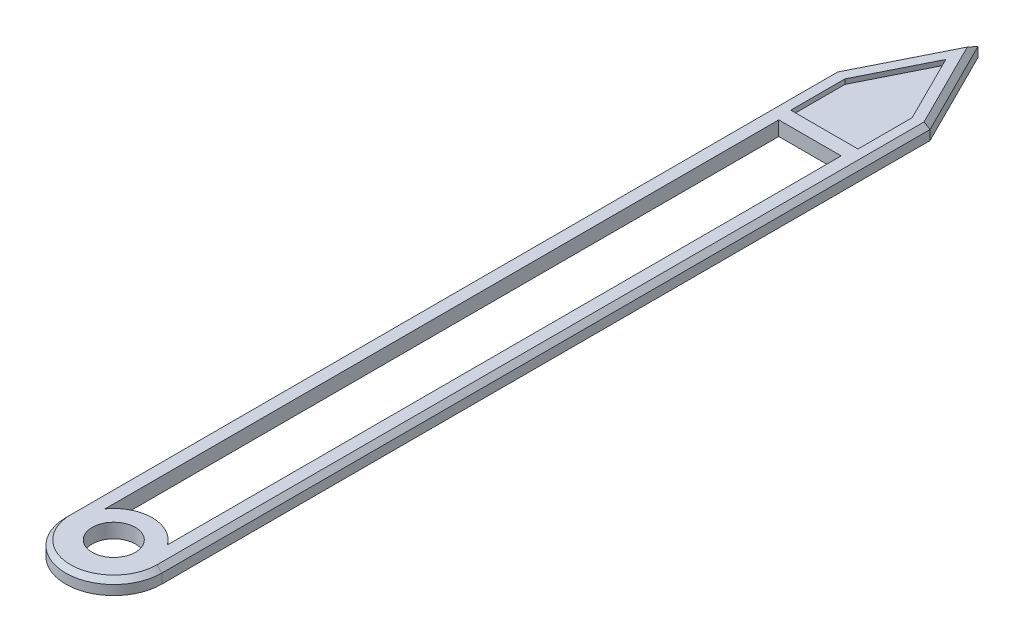
ISO-10303-21;
HEADER;
FILE_DESCRIPTION(('STEP AP214'),'2;1');
FILE_NAME('part.step','',(''),(''),'','','');
FILE_SCHEMA(('AUTOMOTIVE_DESIGN { 1 0 10303 214 1 1 1 1 }'));
ENDSEC;
DATA;
#1=APPLICATION_CONTEXT('core data for automotive mechanical design processes');
#2=APPLICATION_PROTOCOL_DEFINITION('international standard','automotive_design',2000,#1);
#3=PRODUCT_CONTEXT('',#1,'mechanical');
#4=PRODUCT('Part','Part','',(#3));
#5=PRODUCT_RELATED_PRODUCT_CATEGORY('part','',(#4));
#6=PRODUCT_DEFINITION_FORMATION('','',#4);
#7=PRODUCT_DEFINITION_CONTEXT('part definition',#1,'design');
#8=PRODUCT_DEFINITION('design','',#6,#7);
#9=PRODUCT_DEFINITION_SHAPE('','',#8);
#10=(LENGTH_UNIT() NAMED_UNIT(*) SI_UNIT(.MILLI.,.METRE.));
#11=(NAMED_UNIT(*) PLANE_ANGLE_UNIT() SI_UNIT($,.RADIAN.));
#12=(NAMED_UNIT(*) SI_UNIT($,.STERADIAN.) SOLID_ANGLE_UNIT());
#13=UNCERTAINTY_MEASURE_WITH_UNIT(LENGTH_MEASURE(1.E-05),#10,'distance_accuracy_value','');
#14=(GEOMETRIC_REPRESENTATION_CONTEXT(3) GLOBAL_UNCERTAINTY_ASSIGNED_CONTEXT((#13)) GLOBAL_UNIT_ASSIGNED_CONTEXT((#10,
#11,#12)) REPRESENTATION_CONTEXT('',''));
#15=CARTESIAN_POINT('',(0.,0.,0.));
#16=DIRECTION('',(0.,0.,1.));
#17=DIRECTION('',(1.,0.,0.));
#18=AXIS2_PLACEMENT_3D('',#15,#16,#17);
#19=CARTESIAN_POINT('',(0.,0.3,0.));
#20=DIRECTION('',(0.,1.,0.));
#21=DIRECTION('',(0.,0.,1.));
#22=AXIS2_PLACEMENT_3D('',#19,#20,#21);
#23=PLANE('',#22);
#24=DIRECTION('',(-0.447213595499958,0.,0.894427190999916));
#25=VECTOR('',#24,1.);
#26=CARTESIAN_POINT('',(-0.910557280900006,0.3,-15.95527864045));
#27=LINE('',#26,#25);
#28=CARTESIAN_POINT('',(0.,0.3,-17.77639320225));
#29=VERTEX_POINT('',#28);
#30=CARTESIAN_POINT('',(-0.899999999999997,0.3,-15.97639320225));
#31=VERTEX_POINT('',#30);
#32=EDGE_CURVE('E346',#29,#31,#27,.T.);
#33=ORIENTED_EDGE('',*,*,#32,.T.);
#34=DIRECTION('',(0.,0.,1.));
#35=VECTOR('',#34,1.);
#36=CARTESIAN_POINT('',(-0.899999999999997,0.3,0.));
#37=LINE('',#36,#35);
#38=CARTESIAN_POINT('',(-0.899999999999997,0.3,0.));
#39=VERTEX_POINT('',#38);
#40=EDGE_CURVE('E352',#31,#39,#37,.T.);
#41=ORIENTED_EDGE('',*,*,#40,.T.);
#42=CARTESIAN_POINT('',(0.,0.3,0.));
#43=DIRECTION('',(0.,1.,0.));
#44=DIRECTION('',(0.,0.,1.));
#45=AXIS2_PLACEMENT_3D('',#42,#43,#44);
#46=CIRCLE('',#45,0.899999999999997);
#47=CARTESIAN_POINT('',(0.899999999999997,0.3,0.));
#48=VERTEX_POINT('',#47);
#49=EDGE_CURVE('E349',#39,#48,#46,.T.);
#50=ORIENTED_EDGE('',*,*,#49,.T.);
#51=DIRECTION('',(0.,0.,-1.));
#52=VECTOR('',#51,1.);
#53=CARTESIAN_POINT('',(0.899999999999997,0.3,-16.));
#54=LINE('',#53,#52);
#55=CARTESIAN_POINT('',(0.899999999999997,0.3,-15.97639320225));
#56=VERTEX_POINT('',#55);
#57=EDGE_CURVE('E340',#48,#56,#54,.T.);
#58=ORIENTED_EDGE('',*,*,#57,.T.);
#59=DIRECTION('',(-0.447213595499958,0.,-0.894427190999916));
#60=VECTOR('',#59,1.);
#61=CARTESIAN_POINT('',(-0.0894427190999934,0.3,-17.95527864045));
#62=LINE('',#61,#60);
#63=EDGE_CURVE('E343',#56,#29,#62,.T.);
#64=ORIENTED_EDGE('',*,*,#63,.T.);
#65=EDGE_LOOP('',(#33,#41,#50,#58,#64));
#66=FACE_BOUND('',#65,.T.);
#67=DIRECTION('',(0.,0.,-1.));
#68=VECTOR('',#67,1.);
#69=CARTESIAN_POINT('',(0.700000000000001,0.3,-14.8));
#70=LINE('',#69,#68);
#71=CARTESIAN_POINT('',(0.700000000000001,0.3,-14.8));
#72=VERTEX_POINT('',#71);
#73=CARTESIAN_POINT('',(0.700000000000002,0.3,-15.9291796067501));
#74=VERTEX_POINT('',#73);
#75=EDGE_CURVE('E196',#72,#74,#70,.T.);
#76=ORIENTED_EDGE('',*,*,#75,.F.);
#77=DIRECTION('',(1.,0.,0.));
#78=VECTOR('',#77,1.);
#79=CARTESIAN_POINT('',(-0.7,0.3,-14.8));
#80=LINE('',#79,#78);
#81=CARTESIAN_POINT('',(-0.7,0.3,-14.8));
#82=VERTEX_POINT('',#81);
#83=EDGE_CURVE('E217',#82,#72,#80,.T.);
#84=ORIENTED_EDGE('',*,*,#83,.F.);
#85=DIRECTION('',(0.,0.,1.));
#86=VECTOR('',#85,1.);
#87=CARTESIAN_POINT('',(-0.7,0.3,-15.9291796067501));
#88=LINE('',#87,#86);
#89=CARTESIAN_POINT('',(-0.7,0.3,-15.9291796067501));
#90=VERTEX_POINT('',#89);
#91=EDGE_CURVE('E223',#90,#82,#88,.T.);
#92=ORIENTED_EDGE('',*,*,#91,.F.);
#93=DIRECTION('',(-0.447213595499958,0.,0.894427190999916));
#94=VECTOR('',#93,1.);
#95=CARTESIAN_POINT('',(0.,0.3,-17.3291796067501));
#96=LINE('',#95,#94);
#97=CARTESIAN_POINT('',(0.,0.3,-17.3291796067501));
#98=VERTEX_POINT('',#97);
#99=EDGE_CURVE('E237',#98,#90,#96,.T.);
#100=ORIENTED_EDGE('',*,*,#99,.F.);
#101=DIRECTION('',(-0.447213595499959,0.,-0.894427190999916));
#102=VECTOR('',#101,1.);
#103=CARTESIAN_POINT('',(0.700000000000001,0.3,-15.9291796067501));
#104=LINE('',#103,#102);
#105=EDGE_CURVE('E234',#74,#98,#104,.T.);
#106=ORIENTED_EDGE('',*,*,#105,.F.);
#107=EDGE_LOOP('',(#76,#84,#92,#100,#106));
#108=FACE_BOUND('',#107,.T.);
#109=CARTESIAN_POINT('',(0.,0.3,0.));
#110=DIRECTION('',(0.,1.,0.));
#111=DIRECTION('',(0.,0.,1.));
#112=AXIS2_PLACEMENT_3D('',#109,#110,#111);
#113=CIRCLE('',#112,0.45);
#114=CARTESIAN_POINT('',(0.,0.3,0.45));
#115=VERTEX_POINT('',#114);
#116=EDGE_CURVE('E298',#115,#115,#113,.T.);
#117=ORIENTED_EDGE('',*,*,#116,.F.);
#118=EDGE_LOOP('',(#117));
#119=FACE_BOUND('',#118,.T.);
#120=DIRECTION('',(0.,0.,-1.));
#121=VECTOR('',#120,1.);
#122=CARTESIAN_POINT('',(0.65,0.3,-14.5));
#123=LINE('',#122,#121);
#124=CARTESIAN_POINT('',(0.65,0.3,-0.466368952654441));
#125=VERTEX_POINT('',#124);
#126=CARTESIAN_POINT('',(0.65,0.3,-14.5));
#127=VERTEX_POINT('',#126);
#128=EDGE_CURVE('E258',#125,#127,#123,.T.);
#129=ORIENTED_EDGE('',*,*,#128,.F.);
#130=CARTESIAN_POINT('',(0.,0.3,0.));
#131=DIRECTION('',(0.,-1.,0.));
#132=DIRECTION('',(0.,0.,-1.));
#133=AXIS2_PLACEMENT_3D('',#130,#131,#132);
#134=CIRCLE('',#133,0.8);
#135=CARTESIAN_POINT('',(-0.65,0.3,-0.466368952654441));
#136=VERTEX_POINT('',#135);
#137=EDGE_CURVE('E255',#136,#125,#134,.T.);
#138=ORIENTED_EDGE('',*,*,#137,.F.);
#139=DIRECTION('',(0.,0.,1.));
#140=VECTOR('',#139,1.);
#141=CARTESIAN_POINT('',(-0.65,0.3,-0.466368952654441));
#142=LINE('',#141,#140);
#143=CARTESIAN_POINT('',(-0.65,0.3,-14.5));
#144=VERTEX_POINT('',#143);
#145=EDGE_CURVE('E266',#144,#136,#142,.T.);
#146=ORIENTED_EDGE('',*,*,#145,.F.);
#147=DIRECTION('',(-1.,0.,0.));
#148=VECTOR('',#147,1.);
#149=CARTESIAN_POINT('',(-0.65,0.3,-14.5));
#150=LINE('',#149,#148);
#151=EDGE_CURVE('E262',#127,#144,#150,.T.);
#152=ORIENTED_EDGE('',*,*,#151,.F.);
#153=EDGE_LOOP('',(#129,#138,#146,#152));
#154=FACE_BOUND('',#153,.T.);
#155=ADVANCED_FACE('F38',(#66,#108,#119,#154),#23,.T.);
#156=CARTESIAN_POINT('',(0.,0.,0.));
#157=DIRECTION('',(0.,1.,0.));
#158=DIRECTION('',(0.,0.,1.));
#159=AXIS2_PLACEMENT_3D('',#156,#157,#158);
#160=PLANE('',#159);
#161=CARTESIAN_POINT('',(0.,0.,0.));
#162=DIRECTION('',(0.,1.,0.));
#163=DIRECTION('',(0.,0.,1.));
#164=AXIS2_PLACEMENT_3D('',#161,#162,#163);
#165=CIRCLE('',#164,0.45);
#166=CARTESIAN_POINT('',(0.,0.,0.45));
#167=VERTEX_POINT('',#166);
#168=EDGE_CURVE('E297',#167,#167,#165,.T.);
#169=ORIENTED_EDGE('',*,*,#168,.T.);
#170=EDGE_LOOP('',(#169));
#171=FACE_BOUND('',#170,.T.);
#172=CARTESIAN_POINT('',(0.,0.,0.));
#173=DIRECTION('',(0.,1.,0.));
#174=DIRECTION('',(0.,0.,1.));
#175=AXIS2_PLACEMENT_3D('',#172,#173,#174);
#176=CIRCLE('',#175,1.);
#177=CARTESIAN_POINT('',(-1.,0.,0.));
#178=VERTEX_POINT('',#177);
#179=CARTESIAN_POINT('',(1.,0.,0.));
#180=VERTEX_POINT('',#179);
#181=EDGE_CURVE('E302',#178,#180,#176,.T.);
#182=ORIENTED_EDGE('',*,*,#181,.F.);
#183=DIRECTION('',(0.,0.,1.));
#184=VECTOR('',#183,1.);
#185=CARTESIAN_POINT('',(-1.,0.,0.));
#186=LINE('',#185,#184);
#187=CARTESIAN_POINT('',(-1.,0.,-16.));
#188=VERTEX_POINT('',#187);
#189=EDGE_CURVE('E321',#188,#178,#186,.T.);
#190=ORIENTED_EDGE('',*,*,#189,.F.);
#191=DIRECTION('',(-0.447213595499958,0.,0.894427190999916));
#192=VECTOR('',#191,1.);
#193=CARTESIAN_POINT('',(-1.,0.,-16.));
#194=LINE('',#193,#192);
#195=CARTESIAN_POINT('',(0.,0.,-18.));
#196=VERTEX_POINT('',#195);
#197=EDGE_CURVE('E317',#196,#188,#194,.T.);
#198=ORIENTED_EDGE('',*,*,#197,.F.);
#199=DIRECTION('',(-0.447213595499958,0.,-0.894427190999916));
#200=VECTOR('',#199,1.);
#201=CARTESIAN_POINT('',(0.,0.,-18.));
#202=LINE('',#201,#200);
#203=CARTESIAN_POINT('',(1.,0.,-16.));
#204=VERTEX_POINT('',#203);
#205=EDGE_CURVE('E313',#204,#196,#202,.T.);
#206=ORIENTED_EDGE('',*,*,#205,.F.);
#207=DIRECTION('',(0.,0.,-1.));
#208=VECTOR('',#207,1.);
#209=CARTESIAN_POINT('',(1.,0.,0.));
#210=LINE('',#209,#208);
#211=EDGE_CURVE('E309',#180,#204,#210,.T.);
#212=ORIENTED_EDGE('',*,*,#211,.F.);
#213=EDGE_LOOP('',(#182,#190,#198,#206,#212));
#214=FACE_BOUND('',#213,.T.);
#215=CARTESIAN_POINT('',(0.,0.,0.));
#216=DIRECTION('',(0.,-1.,0.));
#217=DIRECTION('',(0.,0.,-1.));
#218=AXIS2_PLACEMENT_3D('',#215,#216,#217);
#219=CIRCLE('',#218,0.8);
#220=CARTESIAN_POINT('',(-0.65,0.,-0.466368952654441));
#221=VERTEX_POINT('',#220);
#222=CARTESIAN_POINT('',(0.65,0.,-0.466368952654441));
#223=VERTEX_POINT('',#222);
#224=EDGE_CURVE('E246',#221,#223,#219,.T.);
#225=ORIENTED_EDGE('',*,*,#224,.T.);
#226=DIRECTION('',(0.,0.,-1.));
#227=VECTOR('',#226,1.);
#228=CARTESIAN_POINT('',(0.65,0.,-14.5));
#229=LINE('',#228,#227);
#230=CARTESIAN_POINT('',(0.65,0.,-14.5));
#231=VERTEX_POINT('',#230);
#232=EDGE_CURVE('E273',#223,#231,#229,.T.);
#233=ORIENTED_EDGE('',*,*,#232,.T.);
#234=DIRECTION('',(-1.,0.,0.));
#235=VECTOR('',#234,1.);
#236=CARTESIAN_POINT('',(-0.65,0.,-14.5));
#237=LINE('',#236,#235);
#238=CARTESIAN_POINT('',(-0.65,0.,-14.5));
#239=VERTEX_POINT('',#238);
#240=EDGE_CURVE('E277',#231,#239,#237,.T.);
#241=ORIENTED_EDGE('',*,*,#240,.T.);
#242=DIRECTION('',(0.,0.,1.));
#243=VECTOR('',#242,1.);
#244=CARTESIAN_POINT('',(-0.65,0.,-0.466368952654441));
#245=LINE('',#244,#243);
#246=EDGE_CURVE('E259',#239,#221,#245,.T.);
#247=ORIENTED_EDGE('',*,*,#246,.T.);
#248=EDGE_LOOP('',(#225,#233,#241,#247));
#249=FACE_BOUND('',#248,.T.);
#250=ADVANCED_FACE('F421',(#171,#214,#249),#160,.F.);
#251=CARTESIAN_POINT('',(0.,0.3,0.));
#252=DIRECTION('',(0.,-1.,0.));
#253=DIRECTION('',(0.,0.,-1.));
#254=AXIS2_PLACEMENT_3D('',#251,#252,#253);
#255=CYLINDRICAL_SURFACE('',#254,1.);
#256=DIRECTION('',(0.,-1.,0.));
#257=VECTOR('',#256,1.);
#258=CARTESIAN_POINT('',(1.,0.3,0.));
#259=LINE('',#258,#257);
#260=CARTESIAN_POINT('',(1.,0.199999999999997,0.));
#261=VERTEX_POINT('',#260);
#262=EDGE_CURVE('E337',#261,#180,#259,.T.);
#263=ORIENTED_EDGE('',*,*,#262,.F.);
#264=CARTESIAN_POINT('',(0.,0.199999999999997,0.));
#265=DIRECTION('',(0.,1.,0.));
#266=DIRECTION('',(0.,0.,1.));
#267=AXIS2_PLACEMENT_3D('',#264,#265,#266);
#268=CIRCLE('',#267,1.);
#269=CARTESIAN_POINT('',(-1.,0.199999999999997,0.));
#270=VERTEX_POINT('',#269);
#271=EDGE_CURVE('E360',#261,#270,#268,.F.);
#272=ORIENTED_EDGE('',*,*,#271,.T.);
#273=DIRECTION('',(0.,-1.,0.));
#274=VECTOR('',#273,1.);
#275=CARTESIAN_POINT('',(-1.,0.3,0.));
#276=LINE('',#275,#274);
#277=EDGE_CURVE('E325',#270,#178,#276,.T.);
#278=ORIENTED_EDGE('',*,*,#277,.T.);
#279=ORIENTED_EDGE('',*,*,#181,.T.);
#280=EDGE_LOOP('',(#263,#272,#278,#279));
#281=FACE_BOUND('',#280,.T.);
#282=ADVANCED_FACE('F404',(#281),#255,.T.);
#283=CARTESIAN_POINT('',(1.,0.3,0.));
#284=DIRECTION('',(-1.,0.,0.));
#285=DIRECTION('',(0.,0.,1.));
#286=AXIS2_PLACEMENT_3D('',#283,#284,#285);
#287=PLANE('',#286);
#288=DIRECTION('',(0.,-1.,0.));
#289=VECTOR('',#288,1.);
#290=CARTESIAN_POINT('',(1.,0.3,-16.));
#291=LINE('',#290,#289);
#292=CARTESIAN_POINT('',(1.,0.199999999999997,-16.));
#293=VERTEX_POINT('',#292);
#294=EDGE_CURVE('E334',#293,#204,#291,.T.);
#295=ORIENTED_EDGE('',*,*,#294,.F.);
#296=DIRECTION('',(0.,0.,1.));
#297=VECTOR('',#296,1.);
#298=CARTESIAN_POINT('',(1.,0.199999999999997,0.));
#299=LINE('',#298,#297);
#300=EDGE_CURVE('E11',#293,#261,#299,.T.);
#301=ORIENTED_EDGE('',*,*,#300,.T.);
#302=ORIENTED_EDGE('',*,*,#262,.T.);
#303=ORIENTED_EDGE('',*,*,#211,.T.);
#304=EDGE_LOOP('',(#295,#301,#302,#303));
#305=FACE_BOUND('',#304,.T.);
#306=ADVANCED_FACE('F440',(#305),#287,.F.);
#307=CARTESIAN_POINT('',(0.,0.3,-18.));
#308=DIRECTION('',(-0.894427190999916,0.,0.447213595499958));
#309=DIRECTION('',(0.447213595499958,0.,0.894427190999916));
#310=AXIS2_PLACEMENT_3D('',#307,#308,#309);
#311=PLANE('',#310);
#312=DIRECTION('',(0.,-1.,0.));
#313=VECTOR('',#312,1.);
#314=CARTESIAN_POINT('',(0.,0.3,-18.));
#315=LINE('',#314,#313);
#316=CARTESIAN_POINT('',(0.,0.199999999999997,-18.));
#317=VERTEX_POINT('',#316);
#318=EDGE_CURVE('E331',#317,#196,#315,.T.);
#319=ORIENTED_EDGE('',*,*,#318,.F.);
#320=DIRECTION('',(0.447213595499958,0.,0.894427190999916));
#321=VECTOR('',#320,1.);
#322=CARTESIAN_POINT('',(1.,0.199999999999997,-16.));
#323=LINE('',#322,#321);
#324=EDGE_CURVE('E48',#317,#293,#323,.T.);
#325=ORIENTED_EDGE('',*,*,#324,.T.);
#326=ORIENTED_EDGE('',*,*,#294,.T.);
#327=ORIENTED_EDGE('',*,*,#205,.T.);
#328=EDGE_LOOP('',(#319,#325,#326,#327));
#329=FACE_BOUND('',#328,.T.);
#330=ADVANCED_FACE('F437',(#329),#311,.F.);
#331=CARTESIAN_POINT('',(-1.,0.3,-16.));
#332=DIRECTION('',(0.894427190999916,0.,0.447213595499958));
#333=DIRECTION('',(0.447213595499958,0.,-0.894427190999916));
#334=AXIS2_PLACEMENT_3D('',#331,#332,#333);
#335=PLANE('',#334);
#336=DIRECTION('',(0.,-1.,0.));
#337=VECTOR('',#336,1.);
#338=CARTESIAN_POINT('',(-1.,0.3,-16.));
#339=LINE('',#338,#337);
#340=CARTESIAN_POINT('',(-1.,0.199999999999997,-16.));
#341=VERTEX_POINT('',#340);
#342=EDGE_CURVE('E328',#341,#188,#339,.T.);
#343=ORIENTED_EDGE('',*,*,#342,.F.);
#344=DIRECTION('',(0.447213595499958,0.,-0.894427190999916));
#345=VECTOR('',#344,1.);
#346=CARTESIAN_POINT('',(0.,0.199999999999996,-18.));
#347=LINE('',#346,#345);
#348=EDGE_CURVE('E69',#341,#317,#347,.T.);
#349=ORIENTED_EDGE('',*,*,#348,.T.);
#350=ORIENTED_EDGE('',*,*,#318,.T.);
#351=ORIENTED_EDGE('',*,*,#197,.T.);
#352=EDGE_LOOP('',(#343,#349,#350,#351));
#353=FACE_BOUND('',#352,.T.);
#354=ADVANCED_FACE('F434',(#353),#335,.F.);
#355=CARTESIAN_POINT('',(-1.,0.3,0.));
#356=DIRECTION('',(1.,0.,0.));
#357=DIRECTION('',(0.,0.,-1.));
#358=AXIS2_PLACEMENT_3D('',#355,#356,#357);
#359=PLANE('',#358);
#360=ORIENTED_EDGE('',*,*,#277,.F.);
#361=DIRECTION('',(0.,0.,-1.));
#362=VECTOR('',#361,1.);
#363=CARTESIAN_POINT('',(-1.,0.199999999999997,-16.));
#364=LINE('',#363,#362);
#365=EDGE_CURVE('E356',#270,#341,#364,.T.);
#366=ORIENTED_EDGE('',*,*,#365,.T.);
#367=ORIENTED_EDGE('',*,*,#342,.T.);
#368=ORIENTED_EDGE('',*,*,#189,.T.);
#369=EDGE_LOOP('',(#360,#366,#367,#368));
#370=FACE_BOUND('',#369,.T.);
#371=ADVANCED_FACE('F407',(#370),#359,.F.);
#372=CARTESIAN_POINT('',(0.,0.3,0.));
#373=DIRECTION('',(0.,-1.,0.));
#374=DIRECTION('',(0.,0.,-1.));
#375=AXIS2_PLACEMENT_3D('',#372,#373,#374);
#376=CYLINDRICAL_SURFACE('',#375,0.45);
#377=ORIENTED_EDGE('',*,*,#116,.T.);
#378=EDGE_LOOP('',(#377));
#379=FACE_BOUND('',#378,.T.);
#380=ORIENTED_EDGE('',*,*,#168,.F.);
#381=EDGE_LOOP('',(#380));
#382=FACE_BOUND('',#381,.T.);
#383=ADVANCED_FACE('F429',(#379,#382),#376,.F.);
#384=CARTESIAN_POINT('',(0.,0.3,0.));
#385=DIRECTION('',(0.,-1.,0.));
#386=DIRECTION('',(0.,0.,-1.));
#387=AXIS2_PLACEMENT_3D('',#384,#385,#386);
#388=CYLINDRICAL_SURFACE('',#387,0.8);
#389=ORIENTED_EDGE('',*,*,#224,.F.);
#390=DIRECTION('',(0.,-1.,0.));
#391=VECTOR('',#390,1.);
#392=CARTESIAN_POINT('',(-0.65,0.3,-0.466368952654441));
#393=LINE('',#392,#391);
#394=EDGE_CURVE('E269',#136,#221,#393,.T.);
#395=ORIENTED_EDGE('',*,*,#394,.F.);
#396=ORIENTED_EDGE('',*,*,#137,.T.);
#397=DIRECTION('',(0.,-1.,0.));
#398=VECTOR('',#397,1.);
#399=CARTESIAN_POINT('',(0.65,0.3,-0.466368952654441));
#400=LINE('',#399,#398);
#401=EDGE_CURVE('E293',#125,#223,#400,.T.);
#402=ORIENTED_EDGE('',*,*,#401,.T.);
#403=EDGE_LOOP('',(#389,#395,#396,#402));
#404=FACE_BOUND('',#403,.T.);
#405=ADVANCED_FACE('F462',(#404),#388,.T.);
#406=CARTESIAN_POINT('',(0.65,0.3,-14.5));
#407=DIRECTION('',(-1.,0.,0.));
#408=DIRECTION('',(0.,0.,1.));
#409=AXIS2_PLACEMENT_3D('',#406,#407,#408);
#410=PLANE('',#409);
#411=ORIENTED_EDGE('',*,*,#232,.F.);
#412=ORIENTED_EDGE('',*,*,#401,.F.);
#413=ORIENTED_EDGE('',*,*,#128,.T.);
#414=DIRECTION('',(0.,-1.,0.));
#415=VECTOR('',#414,1.);
#416=CARTESIAN_POINT('',(0.65,0.3,-14.5));
#417=LINE('',#416,#415);
#418=EDGE_CURVE('E290',#127,#231,#417,.T.);
#419=ORIENTED_EDGE('',*,*,#418,.T.);
#420=EDGE_LOOP('',(#411,#412,#413,#419));
#421=FACE_BOUND('',#420,.T.);
#422=ADVANCED_FACE('F505',(#421),#410,.T.);
#423=CARTESIAN_POINT('',(-0.65,0.3,-14.5));
#424=DIRECTION('',(0.,0.,1.));
#425=DIRECTION('',(1.,0.,0.));
#426=AXIS2_PLACEMENT_3D('',#423,#424,#425);
#427=PLANE('',#426);
#428=ORIENTED_EDGE('',*,*,#240,.F.);
#429=ORIENTED_EDGE('',*,*,#418,.F.);
#430=ORIENTED_EDGE('',*,*,#151,.T.);
#431=DIRECTION('',(0.,-1.,0.));
#432=VECTOR('',#431,1.);
#433=CARTESIAN_POINT('',(-0.65,0.3,-14.5));
#434=LINE('',#433,#432);
#435=EDGE_CURVE('E287',#144,#239,#434,.T.);
#436=ORIENTED_EDGE('',*,*,#435,.T.);
#437=EDGE_LOOP('',(#428,#429,#430,#436));
#438=FACE_BOUND('',#437,.T.);
#439=ADVANCED_FACE('F508',(#438),#427,.T.);
#440=CARTESIAN_POINT('',(-0.65,0.3,-0.466368952654441));
#441=DIRECTION('',(1.,0.,0.));
#442=DIRECTION('',(0.,0.,-1.));
#443=AXIS2_PLACEMENT_3D('',#440,#441,#442);
#444=PLANE('',#443);
#445=ORIENTED_EDGE('',*,*,#246,.F.);
#446=ORIENTED_EDGE('',*,*,#435,.F.);
#447=ORIENTED_EDGE('',*,*,#145,.T.);
#448=ORIENTED_EDGE('',*,*,#394,.T.);
#449=EDGE_LOOP('',(#445,#446,#447,#448));
#450=FACE_BOUND('',#449,.T.);
#451=ADVANCED_FACE('F497',(#450),#444,.T.);
#452=CARTESIAN_POINT('',(0.700000000000001,0.2,-14.8));
#453=DIRECTION('',(1.,0.,0.));
#454=DIRECTION('',(0.,0.,-1.));
#455=AXIS2_PLACEMENT_3D('',#452,#453,#454);
#456=PLANE('',#455);
#457=ORIENTED_EDGE('',*,*,#75,.T.);
#458=DIRECTION('',(0.,1.,0.));
#459=VECTOR('',#458,1.);
#460=CARTESIAN_POINT('',(0.700000000000001,0.2,-15.9291796067501));
#461=LINE('',#460,#459);
#462=CARTESIAN_POINT('',(0.700000000000001,0.2,-15.9291796067501));
#463=VERTEX_POINT('',#462);
#464=EDGE_CURVE('E189',#463,#74,#461,.T.);
#465=ORIENTED_EDGE('',*,*,#464,.F.);
#466=DIRECTION('',(0.,0.,-1.));
#467=VECTOR('',#466,1.);
#468=CARTESIAN_POINT('',(0.700000000000001,0.2,-14.8));
#469=LINE('',#468,#467);
#470=CARTESIAN_POINT('',(0.700000000000001,0.2,-14.8));
#471=VERTEX_POINT('',#470);
#472=EDGE_CURVE('E193',#471,#463,#469,.T.);
#473=ORIENTED_EDGE('',*,*,#472,.F.);
#474=DIRECTION('',(0.,1.,0.));
#475=VECTOR('',#474,1.);
#476=CARTESIAN_POINT('',(0.700000000000001,0.2,-14.8));
#477=LINE('',#476,#475);
#478=EDGE_CURVE('E244',#471,#72,#477,.T.);
#479=ORIENTED_EDGE('',*,*,#478,.T.);
#480=EDGE_LOOP('',(#457,#465,#473,#479));
#481=FACE_BOUND('',#480,.T.);
#482=ADVANCED_FACE('F191',(#481),#456,.F.);
#483=CARTESIAN_POINT('',(-0.7,0.2,-14.8));
#484=DIRECTION('',(0.,0.,1.));
#485=DIRECTION('',(1.,0.,0.));
#486=AXIS2_PLACEMENT_3D('',#483,#484,#485);
#487=PLANE('',#486);
#488=ORIENTED_EDGE('',*,*,#83,.T.);
#489=ORIENTED_EDGE('',*,*,#478,.F.);
#490=DIRECTION('',(1.,0.,0.));
#491=VECTOR('',#490,1.);
#492=CARTESIAN_POINT('',(-0.7,0.2,-14.8));
#493=LINE('',#492,#491);
#494=CARTESIAN_POINT('',(-0.7,0.2,-14.8));
#495=VERTEX_POINT('',#494);
#496=EDGE_CURVE('E202',#495,#471,#493,.T.);
#497=ORIENTED_EDGE('',*,*,#496,.F.);
#498=DIRECTION('',(0.,1.,0.));
#499=VECTOR('',#498,1.);
#500=CARTESIAN_POINT('',(-0.7,0.2,-14.8));
#501=LINE('',#500,#499);
#502=EDGE_CURVE('E247',#495,#82,#501,.T.);
#503=ORIENTED_EDGE('',*,*,#502,.T.);
#504=EDGE_LOOP('',(#488,#489,#497,#503));
#505=FACE_BOUND('',#504,.T.);
#506=ADVANCED_FACE('F529',(#505),#487,.F.);
#507=CARTESIAN_POINT('',(-0.7,0.2,-15.9291796067501));
#508=DIRECTION('',(-1.,0.,0.));
#509=DIRECTION('',(0.,0.,1.));
#510=AXIS2_PLACEMENT_3D('',#507,#508,#509);
#511=PLANE('',#510);
#512=ORIENTED_EDGE('',*,*,#91,.T.);
#513=ORIENTED_EDGE('',*,*,#502,.F.);
#514=DIRECTION('',(0.,0.,1.));
#515=VECTOR('',#514,1.);
#516=CARTESIAN_POINT('',(-0.7,0.2,-15.9291796067501));
#517=LINE('',#516,#515);
#518=CARTESIAN_POINT('',(-0.7,0.2,-15.9291796067501));
#519=VERTEX_POINT('',#518);
#520=EDGE_CURVE('E228',#519,#495,#517,.T.);
#521=ORIENTED_EDGE('',*,*,#520,.F.);
#522=DIRECTION('',(0.,1.,0.));
#523=VECTOR('',#522,1.);
#524=CARTESIAN_POINT('',(-0.7,0.2,-15.9291796067501));
#525=LINE('',#524,#523);
#526=EDGE_CURVE('E250',#519,#90,#525,.T.);
#527=ORIENTED_EDGE('',*,*,#526,.T.);
#528=EDGE_LOOP('',(#512,#513,#521,#527));
#529=FACE_BOUND('',#528,.T.);
#530=ADVANCED_FACE('F536',(#529),#511,.F.);
#531=CARTESIAN_POINT('',(0.,0.2,-17.3291796067501));
#532=DIRECTION('',(-0.894427190999916,0.,-0.447213595499958));
#533=DIRECTION('',(-0.447213595499958,0.,0.894427190999916));
#534=AXIS2_PLACEMENT_3D('',#531,#532,#533);
#535=PLANE('',#534);
#536=ORIENTED_EDGE('',*,*,#99,.T.);
#537=ORIENTED_EDGE('',*,*,#526,.F.);
#538=DIRECTION('',(-0.447213595499958,0.,0.894427190999916));
#539=VECTOR('',#538,1.);
#540=CARTESIAN_POINT('',(0.,0.2,-17.3291796067501));
#541=LINE('',#540,#539);
#542=CARTESIAN_POINT('',(0.,0.2,-17.3291796067501));
#543=VERTEX_POINT('',#542);
#544=EDGE_CURVE('E211',#543,#519,#541,.T.);
#545=ORIENTED_EDGE('',*,*,#544,.F.);
#546=DIRECTION('',(0.,1.,0.));
#547=VECTOR('',#546,1.);
#548=CARTESIAN_POINT('',(0.,0.2,-17.3291796067501));
#549=LINE('',#548,#547);
#550=EDGE_CURVE('E201',#543,#98,#549,.T.);
#551=ORIENTED_EDGE('',*,*,#550,.T.);
#552=EDGE_LOOP('',(#536,#537,#545,#551));
#553=FACE_BOUND('',#552,.T.);
#554=ADVANCED_FACE('F544',(#553),#535,.F.);
#555=CARTESIAN_POINT('',(0.700000000000001,0.2,-15.9291796067501));
#556=DIRECTION('',(0.894427190999916,0.,-0.447213595499959));
#557=DIRECTION('',(-0.447213595499959,0.,-0.894427190999916));
#558=AXIS2_PLACEMENT_3D('',#555,#556,#557);
#559=PLANE('',#558);
#560=ORIENTED_EDGE('',*,*,#105,.T.);
#561=ORIENTED_EDGE('',*,*,#550,.F.);
#562=DIRECTION('',(-0.447213595499959,0.,-0.894427190999916));
#563=VECTOR('',#562,1.);
#564=CARTESIAN_POINT('',(0.700000000000001,0.2,-15.9291796067501));
#565=LINE('',#564,#563);
#566=EDGE_CURVE('E205',#463,#543,#565,.T.);
#567=ORIENTED_EDGE('',*,*,#566,.F.);
#568=ORIENTED_EDGE('',*,*,#464,.T.);
#569=EDGE_LOOP('',(#560,#561,#567,#568));
#570=FACE_BOUND('',#569,.T.);
#571=ADVANCED_FACE('F206',(#570),#559,.F.);
#572=CARTESIAN_POINT('',(0.,0.2,0.));
#573=DIRECTION('',(0.,-1.,0.));
#574=DIRECTION('',(0.,0.,-1.));
#575=AXIS2_PLACEMENT_3D('',#572,#573,#574);
#576=PLANE('',#575);
#577=ORIENTED_EDGE('',*,*,#472,.T.);
#578=ORIENTED_EDGE('',*,*,#566,.T.);
#579=ORIENTED_EDGE('',*,*,#544,.T.);
#580=ORIENTED_EDGE('',*,*,#520,.T.);
#581=ORIENTED_EDGE('',*,*,#496,.T.);
#582=EDGE_LOOP('',(#577,#578,#579,#580,#581));
#583=FACE_BOUND('',#582,.T.);
#584=ADVANCED_FACE('F213',(#583),#576,.F.);
#585=CARTESIAN_POINT('',(7.11055728090001,0.3,-3.55527864045001));
#586=DIRECTION('',(0.632455532033673,0.707106781186551,-0.316227766016837));
#587=DIRECTION('',(0.447213595499958,0.,0.894427190999916));
#588=AXIS2_PLACEMENT_3D('',#585,#586,#587);
#589=PLANE('',#588);
#590=DIRECTION('',(0.,0.408248290463862,0.912870929175277));
#591=VECTOR('',#590,1.);
#592=CARTESIAN_POINT('',(0.,5.59989647933281,-5.92546440075001));
#593=LINE('',#592,#591);
#594=EDGE_CURVE('E376',#29,#317,#593,.F.);
#595=ORIENTED_EDGE('',*,*,#594,.F.);
#596=ORIENTED_EDGE('',*,*,#63,.F.);
#597=DIRECTION('',(-0.697456562333054,0.697456562333054,0.164647160063933));
#598=VECTOR('',#597,1.);
#599=CARTESIAN_POINT('',(-0.934637007365747,2.13463700736574,-15.5432941544749));
#600=LINE('',#599,#598);
#601=EDGE_CURVE('E42',#293,#56,#600,.T.);
#602=ORIENTED_EDGE('',*,*,#601,.F.);
#603=ORIENTED_EDGE('',*,*,#324,.F.);
#604=EDGE_LOOP('',(#595,#596,#602,#603));
#605=FACE_BOUND('',#604,.T.);
#606=ADVANCED_FACE('F40',(#605),#589,.T.);
#607=CARTESIAN_POINT('',(0.899999999999997,0.3,0.));
#608=DIRECTION('',(0.707106781186548,0.707106781186548,0.));
#609=DIRECTION('',(0.,0.,1.));
#610=AXIS2_PLACEMENT_3D('',#607,#608,#609);
#611=PLANE('',#610);
#612=ORIENTED_EDGE('',*,*,#601,.T.);
#613=ORIENTED_EDGE('',*,*,#57,.F.);
#614=DIRECTION('',(-0.707106781186548,0.707106781186548,0.));
#615=VECTOR('',#614,1.);
#616=CARTESIAN_POINT('',(1.,0.199999999999997,0.));
#617=LINE('',#616,#615);
#618=EDGE_CURVE('E373',#261,#48,#617,.T.);
#619=ORIENTED_EDGE('',*,*,#618,.F.);
#620=ORIENTED_EDGE('',*,*,#300,.F.);
#621=EDGE_LOOP('',(#612,#613,#619,#620));
#622=FACE_BOUND('',#621,.T.);
#623=ADVANCED_FACE('F388',(#622),#611,.T.);
#624=CARTESIAN_POINT('',(-7.11055728090001,0.3,-3.55527864045001));
#625=DIRECTION('',(-0.632455532033676,0.707106781186548,-0.316227766016838));
#626=DIRECTION('',(0.447213595499958,0.,-0.894427190999916));
#627=AXIS2_PLACEMENT_3D('',#624,#625,#626);
#628=PLANE('',#627);
#629=ORIENTED_EDGE('',*,*,#594,.T.);
#630=ORIENTED_EDGE('',*,*,#348,.F.);
#631=DIRECTION('',(0.697456562333055,0.697456562333055,0.16464716006392));
#632=VECTOR('',#631,1.);
#633=CARTESIAN_POINT('',(-2.49472933407324,-1.29472933407324,-16.3528577308043));
#634=LINE('',#633,#632);
#635=EDGE_CURVE('E370',#31,#341,#634,.F.);
#636=ORIENTED_EDGE('',*,*,#635,.F.);
#637=ORIENTED_EDGE('',*,*,#32,.F.);
#638=EDGE_LOOP('',(#629,#630,#636,#637));
#639=FACE_BOUND('',#638,.T.);
#640=ADVANCED_FACE('F412',(#639),#628,.T.);
#641=CARTESIAN_POINT('',(0.,0.3,0.));
#642=DIRECTION('',(0.,-1.,0.));
#643=DIRECTION('',(0.,0.,-1.));
#644=AXIS2_PLACEMENT_3D('',#641,#642,#643);
#645=CONICAL_SURFACE('',#644,0.899999999999997,0.785398163397448);
#646=ORIENTED_EDGE('',*,*,#618,.T.);
#647=ORIENTED_EDGE('',*,*,#49,.F.);
#648=DIRECTION('',(0.707106781186548,0.707106781186548,0.));
#649=VECTOR('',#648,1.);
#650=CARTESIAN_POINT('',(-1.,0.199999999999997,0.));
#651=LINE('',#650,#649);
#652=EDGE_CURVE('E367',#270,#39,#651,.T.);
#653=ORIENTED_EDGE('',*,*,#652,.F.);
#654=ORIENTED_EDGE('',*,*,#271,.F.);
#655=EDGE_LOOP('',(#646,#647,#653,#654));
#656=FACE_BOUND('',#655,.T.);
#657=ADVANCED_FACE('F399',(#656),#645,.T.);
#658=CARTESIAN_POINT('',(-0.899999999999997,0.3,0.));
#659=DIRECTION('',(-0.707106781186548,0.707106781186548,0.));
#660=DIRECTION('',(0.,0.,-1.));
#661=AXIS2_PLACEMENT_3D('',#658,#659,#660);
#662=PLANE('',#661);
#663=ORIENTED_EDGE('',*,*,#635,.T.);
#664=ORIENTED_EDGE('',*,*,#365,.F.);
#665=ORIENTED_EDGE('',*,*,#652,.T.);
#666=ORIENTED_EDGE('',*,*,#40,.F.);
#667=EDGE_LOOP('',(#663,#664,#665,#666));
#668=FACE_BOUND('',#667,.T.);
#669=ADVANCED_FACE('F411',(#668),#662,.T.);
#670=CLOSED_SHELL('',(#155,#250,#282,#306,#330,#354,#371,#383,#405,#422,#439,#451,#482,#506,
#530,#554,#571,#584,#606,#623,#640,#657,#669));
#671=MANIFOLD_SOLID_BREP('B2',#670);
#672=ADVANCED_BREP_SHAPE_REPRESENTATION('',(#18,#671),#14);
#673=SHAPE_DEFINITION_REPRESENTATION(#9,#672);
ENDSEC;
END-ISO-10303-21;
